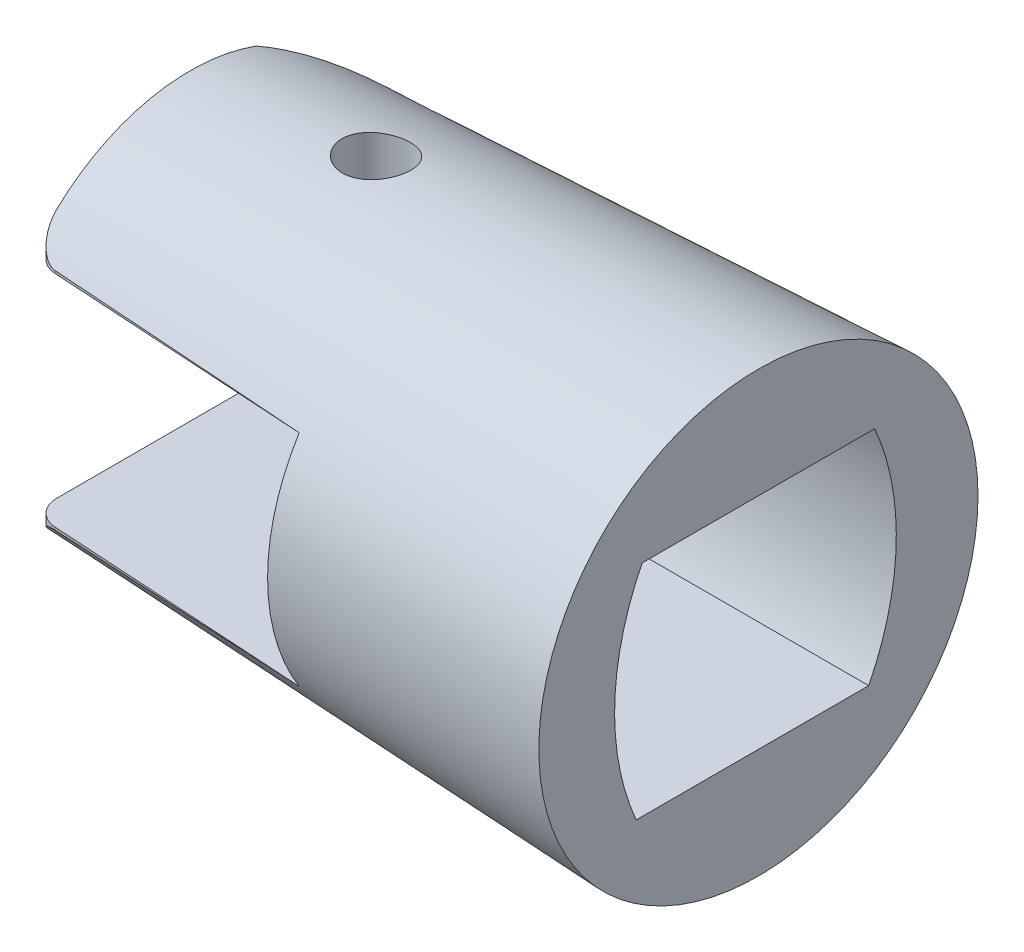
ISO-10303-21;
HEADER;
FILE_DESCRIPTION(('STEP AP214'),'2;1');
FILE_NAME('part.step','',(''),(''),'','','');
FILE_SCHEMA(('AUTOMOTIVE_DESIGN { 1 0 10303 214 1 1 1 1 }'));
ENDSEC;
DATA;
#1=APPLICATION_CONTEXT('core data for automotive mechanical design processes');
#2=APPLICATION_PROTOCOL_DEFINITION('international standard','automotive_design',2000,#1);
#3=PRODUCT_CONTEXT('',#1,'mechanical');
#4=PRODUCT('Part','Part','',(#3));
#5=PRODUCT_RELATED_PRODUCT_CATEGORY('part','',(#4));
#6=PRODUCT_DEFINITION_FORMATION('','',#4);
#7=PRODUCT_DEFINITION_CONTEXT('part definition',#1,'design');
#8=PRODUCT_DEFINITION('design','',#6,#7);
#9=PRODUCT_DEFINITION_SHAPE('','',#8);
#10=(LENGTH_UNIT() NAMED_UNIT(*) SI_UNIT(.MILLI.,.METRE.));
#11=(NAMED_UNIT(*) PLANE_ANGLE_UNIT() SI_UNIT($,.RADIAN.));
#12=(NAMED_UNIT(*) SI_UNIT($,.STERADIAN.) SOLID_ANGLE_UNIT());
#13=UNCERTAINTY_MEASURE_WITH_UNIT(LENGTH_MEASURE(1.E-05),#10,'distance_accuracy_value','');
#14=(GEOMETRIC_REPRESENTATION_CONTEXT(3) GLOBAL_UNCERTAINTY_ASSIGNED_CONTEXT((#13)) GLOBAL_UNIT_ASSIGNED_CONTEXT((#10,
#11,#12)) REPRESENTATION_CONTEXT('',''));
#15=CARTESIAN_POINT('',(0.,0.,0.));
#16=DIRECTION('',(0.,0.,1.));
#17=DIRECTION('',(1.,0.,0.));
#18=AXIS2_PLACEMENT_3D('',#15,#16,#17);
#19=CARTESIAN_POINT('',(-9.1685,3.542375,8.335));
#20=DIRECTION('',(-1.,0.,0.));
#21=DIRECTION('',(0.,-1.,0.));
#22=AXIS2_PLACEMENT_3D('',#19,#20,#21);
#23=PLANE('',#22);
#24=CARTESIAN_POINT('',(-9.1685,-0.204061880803906,-3.69481483405741));
#25=DIRECTION('',(-1.,0.,0.));
#26=DIRECTION('',(0.,-1.,0.));
#27=AXIS2_PLACEMENT_3D('',#24,#25,#26);
#28=CIRCLE('',#27,8.335);
#29=CARTESIAN_POINT('',(-9.1685,-3.542375,3.942455));
#30=VERTEX_POINT('',#29);
#31=CARTESIAN_POINT('',(-9.1685,3.542375,3.75075));
#32=VERTEX_POINT('',#31);
#33=EDGE_CURVE('E354',#30,#32,#28,.T.);
#34=ORIENTED_EDGE('',*,*,#33,.F.);
#35=DIRECTION('',(0.,0.,-1.));
#36=VECTOR('',#35,1.);
#37=CARTESIAN_POINT('',(-9.1685,-3.542375,8.335));
#38=LINE('',#37,#36);
#39=CARTESIAN_POINT('',(-9.1685,-3.542375,5.64923033336179));
#40=VERTEX_POINT('',#39);
#41=EDGE_CURVE('E247',#40,#30,#38,.T.);
#42=ORIENTED_EDGE('',*,*,#41,.F.);
#43=CARTESIAN_POINT('',(-9.1685,0.,0.));
#44=DIRECTION('',(-1.,0.,0.));
#45=DIRECTION('',(0.,-1.,0.));
#46=AXIS2_PLACEMENT_3D('',#43,#44,#45);
#47=CIRCLE('',#46,6.668);
#48=CARTESIAN_POINT('',(-9.1685,3.542375,5.64923033336179));
#49=VERTEX_POINT('',#48);
#50=EDGE_CURVE('E266',#49,#40,#47,.F.);
#51=ORIENTED_EDGE('',*,*,#50,.F.);
#52=DIRECTION('',(0.,0.,-1.));
#53=VECTOR('',#52,1.);
#54=CARTESIAN_POINT('',(-9.1685,3.542375,8.335));
#55=LINE('',#54,#53);
#56=EDGE_CURVE('E243',#49,#32,#55,.T.);
#57=ORIENTED_EDGE('',*,*,#56,.T.);
#58=EDGE_LOOP('',(#34,#42,#51,#57));
#59=FACE_BOUND('',#58,.T.);
#60=ADVANCED_FACE('F42',(#59),#23,.T.);
#61=CARTESIAN_POINT('',(-18.337,0.,0.));
#62=DIRECTION('',(1.,0.,0.));
#63=DIRECTION('',(0.,0.,-1.));
#64=AXIS2_PLACEMENT_3D('',#61,#62,#63);
#65=CONICAL_SURFACE('',#64,6.25125,0.0454232794215771);
#66=CARTESIAN_POINT('',(-13.5019586071199,6.36971735423623,-1.14055263552959));
#67=CARTESIAN_POINT('',(-13.4617716610966,6.36412320489724,-1.18215851716733));
#68=CARTESIAN_POINT('',(-13.4180697769176,6.35886841394281,-1.22045594766293));
#69=CARTESIAN_POINT('',(-13.3247991760596,6.3495885473435,-1.28933223952378));
#70=CARTESIAN_POINT('',(-13.2752260093137,6.34556441284183,-1.31990519051114));
#71=CARTESIAN_POINT('',(-13.1715607820635,6.33923527470254,-1.37242241009831));
#72=CARTESIAN_POINT('',(-13.117466539542,6.33693110656639,-1.39436248269411));
#73=CARTESIAN_POINT('',(-13.0063419314616,6.33440801953943,-1.42891486433509));
#74=CARTESIAN_POINT('',(-12.9493123346254,6.33418855746263,-1.441529602377));
#75=CARTESIAN_POINT('',(-12.8347742077037,6.33599941357175,-1.45695979163238));
#76=CARTESIAN_POINT('',(-12.7772828822114,6.33799901770215,-1.45990684419627));
#77=CARTESIAN_POINT('',(-12.66271516082,6.34416589084581,-1.45632592736047));
#78=CARTESIAN_POINT('',(-12.605638771797,6.34833319569773,-1.44979780130418));
#79=CARTESIAN_POINT('',(-12.4935917215413,6.35859421090259,-1.42754270438879));
#80=CARTESIAN_POINT('',(-12.4386178068363,6.36468479763606,-1.4118306143207));
#81=CARTESIAN_POINT('',(-12.3321352976627,6.37839738600322,-1.37173315382461));
#82=CARTESIAN_POINT('',(-12.2806271160016,6.38601956963775,-1.34734675235603));
#83=CARTESIAN_POINT('',(-12.18128278678,6.40246453529107,-1.28997421611997));
#84=CARTESIAN_POINT('',(-12.1335544490278,6.4113103447212,-1.25680804585947));
#85=CARTESIAN_POINT('',(-12.0443049808552,6.4294504705834,-1.18306878783295));
#86=CARTESIAN_POINT('',(-12.0027847443369,6.4387448513507,-1.14249463525903));
#87=CARTESIAN_POINT('',(-11.9261868389199,6.45735080289865,-1.05402953077276));
#88=CARTESIAN_POINT('',(-11.8912716887303,6.46665822080961,-1.00599678847637));
#89=CARTESIAN_POINT('',(-11.8300392561206,6.48443127201885,-0.904587548632134));
#90=CARTESIAN_POINT('',(-11.8037219229022,6.49289691029039,-0.851211082658894));
#91=CARTESIAN_POINT('',(-11.7605673710761,6.50839634642142,-0.740753092794574));
#92=CARTESIAN_POINT('',(-11.7437001489029,6.51543463011493,-0.683683944152814));
#93=CARTESIAN_POINT('',(-11.7199043216311,6.52768142906514,-0.567320625994102));
#94=CARTESIAN_POINT('',(-11.7129742159587,6.53289022049819,-0.508026793807791));
#95=CARTESIAN_POINT('',(-11.7093849880709,6.54112892195211,-0.390331837808215));
#96=CARTESIAN_POINT('',(-11.7124966428107,6.54420553883841,-0.331940938549516));
#97=CARTESIAN_POINT('',(-11.7284528636226,6.54831759628682,-0.216433119904564));
#98=CARTESIAN_POINT('',(-11.7412965600254,6.54935321920535,-0.159316087153196));
#99=CARTESIAN_POINT('',(-11.7760988297337,6.54952034401941,-0.0488478875469248));
#100=CARTESIAN_POINT('',(-11.7979219574535,6.54867935238531,0.00454600412940212));
#101=CARTESIAN_POINT('',(-11.8500413478639,6.54543836097601,0.106971117293564));
#102=CARTESIAN_POINT('',(-11.8803378998413,6.54303830796999,0.156002189757255));
#103=CARTESIAN_POINT('',(-11.9487637690071,6.53706266680899,0.248659267568056));
#104=CARTESIAN_POINT('',(-11.9869420357534,6.53347964418474,0.292248622895795));
#105=CARTESIAN_POINT('',(-12.0699463889913,6.5256183650566,0.372482766406912));
#106=CARTESIAN_POINT('',(-12.1147730135448,6.52134005227914,0.409126991963025));
#107=CARTESIAN_POINT('',(-12.2105192248659,6.51251616246562,0.474949307668603));
#108=CARTESIAN_POINT('',(-12.2615150564167,6.50796769053918,0.504016164419148));
#109=CARTESIAN_POINT('',(-12.3676767434695,6.49912926922087,0.553197692165532));
#110=CARTESIAN_POINT('',(-12.4228426803699,6.49483932487825,0.573312188362951));
#111=CARTESIAN_POINT('',(-12.5360268180653,6.48688441787331,0.604069794275444));
#112=CARTESIAN_POINT('',(-12.5940550496525,6.48322188905757,0.614676666624468));
#113=CARTESIAN_POINT('',(-12.7111177857693,6.47679656328705,0.625960067390901));
#114=CARTESIAN_POINT('',(-12.7701522518324,6.47403373201934,0.626636974563733));
#115=CARTESIAN_POINT('',(-12.8871853496133,6.46951565682789,0.618044415914074));
#116=CARTESIAN_POINT('',(-12.945188009972,6.46775464310156,0.608832807187882));
#117=CARTESIAN_POINT('',(-13.0588447326471,6.46514461624008,0.580803416808243));
#118=CARTESIAN_POINT('',(-13.1144988188864,6.46429559381307,0.561985733029535));
#119=CARTESIAN_POINT('',(-13.2217147354103,6.463291566282,0.515342450749403));
#120=CARTESIAN_POINT('',(-13.2732875432475,6.46313463268588,0.487542114845976));
#121=CARTESIAN_POINT('',(-13.3710551867452,6.46317931937109,0.423704303595212));
#122=CARTESIAN_POINT('',(-13.4172499008782,6.46338094775309,0.38766664216553));
#123=CARTESIAN_POINT('',(-13.503075999236,6.46374889883847,0.308261270240585));
#124=CARTESIAN_POINT('',(-13.5426891103938,6.46391512359644,0.26487380589709));
#125=CARTESIAN_POINT('',(-13.6140744308321,6.46380459058346,0.172067695741734));
#126=CARTESIAN_POINT('',(-13.645846696026,6.46352783597152,0.122649092941951));
#127=CARTESIAN_POINT('',(-13.7006424871472,6.46217164566769,0.0191969680552867));
#128=CARTESIAN_POINT('',(-13.723667328069,6.46109233069637,-0.0348358588813569));
#129=CARTESIAN_POINT('',(-13.7603213138993,6.4578703411098,-0.145966810634466));
#130=CARTESIAN_POINT('',(-13.7739510396044,6.4557277322404,-0.203064745733771));
#131=CARTESIAN_POINT('',(-13.7914128051149,6.45026810792188,-0.318462500793818));
#132=CARTESIAN_POINT('',(-13.7952815611174,6.44695554707829,-0.376756982727874));
#133=CARTESIAN_POINT('',(-13.7932510697703,6.43919387140256,-0.493109693253887));
#134=CARTESIAN_POINT('',(-13.787349941364,6.43474453783999,-0.551167874191738));
#135=CARTESIAN_POINT('',(-13.7659557953699,6.42489931189144,-0.665564894221748));
#136=CARTESIAN_POINT('',(-13.7504366767053,6.41950087249657,-0.721898615498752));
#137=CARTESIAN_POINT('',(-13.7102529447442,6.4081192459103,-0.831103504416171));
#138=CARTESIAN_POINT('',(-13.6855955394343,6.40213652231534,-0.883977362515132));
#139=CARTESIAN_POINT('',(-13.6353283839342,6.39161911118874,-0.971785450895304));
#140=CARTESIAN_POINT('',(-13.6116140479203,6.38711007390803,-1.00782284775294));
#141=CARTESIAN_POINT('',(-13.5599033905768,6.37824365249002,-1.07670352414049));
#142=CARTESIAN_POINT('',(-13.5319070346157,6.37388626957959,-1.1095467778338));
#143=CARTESIAN_POINT('',(-13.5019586071199,6.36971735423623,-1.14055263552959));
#144=B_SPLINE_CURVE_WITH_KNOTS('',3,(#66,#67,#68,#69,#70,#71,#72,#73,#74,#75,#76,#77,#78,#79,
#80,#81,#82,#83,#84,#85,#86,#87,#88,#89,#90,#91,#92,#93,#94,#95,#96,#97,#98,#99,#100,#101,#102,
#103,#104,#105,#106,#107,#108,#109,#110,#111,#112,#113,#114,#115,#116,#117,#118,#119,#120,#121,
#122,#123,#124,#125,#126,#127,#128,#129,#130,#131,#132,#133,#134,#135,#136,#137,#138,#139,#140,
#141,#142,#143),.UNSPECIFIED.,.T.,.F.,(4,2,2,2,2,2,2,2,2,2,2,2,2,2,2,2,2,2,2,2,2,2,2,2,2,2,2,2,
2,2,2,2,2,2,2,2,2,2,4),(0.,0.174191630600131,0.348516142851444,0.522925281043474,
0.697288974362851,0.869269071700751,1.04125201248106,1.21295705848974,1.38468252041971,
1.56024634392888,1.73583542251076,1.91530202996102,2.09476757705439,2.27366005459238,
2.45252551527688,2.62733714810069,2.80213316134307,2.97438395680036,3.14664063370265,
3.32000116030165,3.49337572489717,3.66916783834825,3.84496338406006,4.02142614263796,
4.19788217043694,4.37331136381457,4.54873876980827,4.72367704063105,4.89861926372467,
5.07403935865661,5.24945820262374,5.42485066554725,5.60023228491239,5.77495321053123,
5.94970778016928,6.12493868394181,6.30003166436285,6.42984305195004,6.55965548946091),.UNSPECIFIED.);
#145=CARTESIAN_POINT('',(-13.5019586071199,6.36971735423623,-1.14055263552959));
#146=VERTEX_POINT('',#145);
#147=EDGE_CURVE('E178',#146,#146,#144,.T.);
#148=ORIENTED_EDGE('',*,*,#147,.T.);
#149=EDGE_LOOP('',(#148));
#150=FACE_BOUND('',#149,.T.);
#151=CARTESIAN_POINT('',(0.,0.,0.));
#152=DIRECTION('',(1.,0.,0.));
#153=DIRECTION('',(0.,0.,-1.));
#154=AXIS2_PLACEMENT_3D('',#151,#152,#153);
#155=CIRCLE('',#154,7.08475);
#156=CARTESIAN_POINT('',(0.,0.,-7.08475));
#157=VERTEX_POINT('',#156);
#158=EDGE_CURVE('E263',#157,#157,#155,.T.);
#159=ORIENTED_EDGE('',*,*,#158,.F.);
#160=EDGE_LOOP('',(#159));
#161=FACE_BOUND('',#160,.T.);
#162=CARTESIAN_POINT('',(-34.5041081604003,0.,4.09963815516563));
#163=DIRECTION('',(-0.0610485395348602,0.,0.998134798421867));
#164=DIRECTION('',(0.998134798421867,0.,0.0610485395348602));
#165=AXIS2_PLACEMENT_3D('',#162,#163,#164);
#166=ELLIPSE('',#165,90.3605801102719,3.69099326311018);
#167=CARTESIAN_POINT('',(-17.5543839577023,-3.62522922712277,5.13632769823078));
#168=VERTEX_POINT('',#167);
#169=EDGE_CURVE('E432',#40,#168,#166,.F.);
#170=ORIENTED_EDGE('',*,*,#169,.T.);
#171=CARTESIAN_POINT('',(-17.5543839577023,-3.62522922712277,5.13632769823078));
#172=CARTESIAN_POINT('',(-17.5835191435355,-3.62539717459501,5.13458204197888));
#173=CARTESIAN_POINT('',(-17.6124407533959,-3.62785684995634,5.13124299283005));
#174=CARTESIAN_POINT('',(-17.6688884168199,-3.63675828304935,5.12179446868215));
#175=CARTESIAN_POINT('',(-17.696426051236,-3.64315736018139,5.11571487211696));
#176=CARTESIAN_POINT('',(-17.756397235893,-3.66137164352762,5.09934388125484));
#177=CARTESIAN_POINT('',(-17.7883530178643,-3.67413604047358,5.08838211572725));
#178=CARTESIAN_POINT('',(-17.849230934616,-3.70364974125853,5.06351345277671));
#179=CARTESIAN_POINT('',(-17.878138434752,-3.72041710985499,5.04959323655003));
#180=CARTESIAN_POINT('',(-17.9467530692136,-3.76604460672441,5.01182369410971));
#181=CARTESIAN_POINT('',(-17.9844507795672,-3.79671127967948,4.98653080374656));
#182=CARTESIAN_POINT('',(-18.0533650839513,-3.86181066792531,4.93231314277607));
#183=CARTESIAN_POINT('',(-18.0845679294244,-3.89625114130658,4.90338087164892));
#184=CARTESIAN_POINT('',(-18.1560385241076,-3.98598020526759,4.82680375002701));
#185=CARTESIAN_POINT('',(-18.1924803505367,-4.04273127487288,4.7773017326093));
#186=CARTESIAN_POINT('',(-18.2532359610207,-4.15817705163775,4.67347504779416));
#187=CARTESIAN_POINT('',(-18.2775417639236,-4.21687301085593,4.61914723433888));
#188=CARTESIAN_POINT('',(-18.3094053683784,-4.3189646501273,4.52149820301437));
#189=CARTESIAN_POINT('',(-18.319683239889,-4.3623377902344,4.47902489375344));
#190=CARTESIAN_POINT('',(-18.3334494794043,-4.4484012157479,4.39267745596563));
#191=CARTESIAN_POINT('',(-18.336965415419,-4.49109356705382,4.34880975969335));
#192=CARTESIAN_POINT('',(-18.3369999999996,-4.5332577855509,4.30438153655579));
#193=B_SPLINE_CURVE_WITH_KNOTS('',3,(#171,#172,#173,#174,#175,#176,#177,#178,#179,#180,#181,
#182,#183,#184,#185,#186,#187,#188,#189,#190,#191,#192),.UNSPECIFIED.,.F.,.F.,(4,2,2,2,2,2,2,2,
2,2,4),(0.,0.0872788149635095,0.173628274098218,0.281375446667443,0.389618375482221,
0.553055908841983,0.716835970926985,0.966494825302895,1.21631765014758,1.40065316914786,
1.58423555666849),.UNSPECIFIED.);
#194=CARTESIAN_POINT('',(-18.337,-4.5332582105943,4.30438194016369));
#195=VERTEX_POINT('',#194);
#196=EDGE_CURVE('E363',#168,#195,#193,.T.);
#197=ORIENTED_EDGE('',*,*,#196,.T.);
#198=CARTESIAN_POINT('',(-18.337,0.,0.));
#199=DIRECTION('',(1.,0.,0.));
#200=DIRECTION('',(0.,0.,-1.));
#201=AXIS2_PLACEMENT_3D('',#198,#199,#200);
#202=CIRCLE('',#201,6.25125);
#203=CARTESIAN_POINT('',(-18.3369999999999,-5.87658981540671,-2.13162349019666));
#204=VERTEX_POINT('',#203);
#205=EDGE_CURVE('E272',#195,#204,#202,.T.);
#206=ORIENTED_EDGE('',*,*,#205,.T.);
#207=CARTESIAN_POINT('',(-18.3372567700002,-5.87674747860965,-2.13115454954993));
#208=CARTESIAN_POINT('',(-18.2423294126869,-5.8184692490237,-2.30454073447208));
#209=CARTESIAN_POINT('',(-18.1409625006472,-5.75405537026979,-2.47212877626095));
#210=CARTESIAN_POINT('',(-17.9268873244713,-5.6151575115782,-2.79505347200545));
#211=CARTESIAN_POINT('',(-17.8141981106003,-5.54069037645025,-2.95040994566567));
#212=CARTESIAN_POINT('',(-17.5789801900571,-5.38387204782082,-3.24842881058492));
#213=CARTESIAN_POINT('',(-17.4564761685077,-5.30154053941646,-3.39112125720009));
#214=CARTESIAN_POINT('',(-17.2023512007276,-5.13074553231019,-3.66428311060505));
#215=CARTESIAN_POINT('',(-17.0707263371003,-5.04227939877835,-3.79474720801791));
#216=CARTESIAN_POINT('',(-16.8000637235818,-4.86176961970861,-4.0426413121732));
#217=CARTESIAN_POINT('',(-16.6610821689153,-4.7697542367641,-4.16015355226417));
#218=CARTESIAN_POINT('',(-16.3753141418655,-4.58351798121941,-4.38330075663128));
#219=CARTESIAN_POINT('',(-16.2285281160942,-4.4892972349938,-4.48893639947214));
#220=CARTESIAN_POINT('',(-15.9274229690926,-4.30090749229415,-4.68832656957107));
#221=CARTESIAN_POINT('',(-15.7731138595806,-4.20673858706263,-4.78209632067535));
#222=CARTESIAN_POINT('',(-15.4565072655595,-4.02088731267653,-4.95792175704519));
#223=CARTESIAN_POINT('',(-15.2942106879906,-3.9292046630442,-5.03997876813072));
#224=CARTESIAN_POINT('',(-15.0225818337167,-3.78453120301848,-5.16402371782553));
#225=CARTESIAN_POINT('',(-14.915834178667,-3.72975971111061,-5.20961497760378));
#226=CARTESIAN_POINT('',(-14.698752330446,-3.62371003482244,-5.29588928003951));
#227=CARTESIAN_POINT('',(-14.5884203081758,-3.57242979212744,-5.33657522579488));
#228=CARTESIAN_POINT('',(-14.3637589629852,-3.47461973201655,-5.41290595950828));
#229=CARTESIAN_POINT('',(-14.2494250792039,-3.42809558847101,-5.44854474544861));
#230=CARTESIAN_POINT('',(-14.0166046533367,-3.34154145003611,-5.5144386646745));
#231=CARTESIAN_POINT('',(-13.8981115599538,-3.30152231596982,-5.54468480233568));
#232=CARTESIAN_POINT('',(-13.7775883,-3.26567429014589,-5.57203211015114));
#233=B_SPLINE_CURVE_WITH_KNOTS('',3,(#207,#208,#209,#210,#211,#212,#213,#214,#215,#216,#217,
#218,#219,#220,#221,#222,#223,#224,#225,#226,#227,#228,#229,#230,#231,#232),.UNSPECIFIED.,.F.,
.F.,(4,2,2,2,2,2,2,2,2,2,2,2,4),(0.,0.617722605789247,1.23442273883692,1.84961777607366,
2.46507869684957,3.0763744709625,3.68763530116436,4.29810376103265,4.90850306422099,
5.29339137725125,5.67805077299071,6.06316382723693,6.44891340803633),.UNSPECIFIED.);
#234=CARTESIAN_POINT('',(-14.5190269000325,-3.542375,-5.35999629482709));
#235=VERTEX_POINT('',#234);
#236=EDGE_CURVE('E236',#204,#235,#233,.T.);
#237=ORIENTED_EDGE('',*,*,#236,.T.);
#238=CARTESIAN_POINT('',(-35.2145239719042,-3.542375,-4.18650456912061));
#239=CARTESIAN_POINT('',(-33.4689798185686,-3.542375,-4.29041241927889));
#240=CARTESIAN_POINT('',(-31.7233440938123,-3.542375,-4.39276675358282));
#241=CARTESIAN_POINT('',(-28.2319248412182,-3.542375,-4.5948589560641));
#242=CARTESIAN_POINT('',(-26.4861413137063,-3.542375,-4.69459682986907));
#243=CARTESIAN_POINT('',(-22.0366149811897,-3.542375,-4.9460842353579));
#244=CARTESIAN_POINT('',(-19.3327882979209,-3.542375,-5.09634776882417));
#245=CARTESIAN_POINT('',(-13.9249199355783,-3.542375,-5.39297364008887));
#246=CARTESIAN_POINT('',(-11.2208782563778,-3.542375,-5.53933597557062));
#247=CARTESIAN_POINT('',(-5.81261229454535,-3.542375,-5.82899950095595));
#248=CARTESIAN_POINT('',(-3.10838801077013,-3.542375,-5.97230066947658));
#249=CARTESIAN_POINT('',(2.30018797093892,-3.542375,-6.25640839517562));
#250=CARTESIAN_POINT('',(5.00453966869321,-3.542375,-6.39721495576955));
#251=CARTESIAN_POINT('',(7.70894062190417,-3.542375,-6.53705820162685));
#252=B_SPLINE_CURVE_WITH_KNOTS('',3,(#238,#239,#240,#241,#242,#243,#244,#245,#246,#247,#248,
#249,#250,#251),.UNSPECIFIED.,.F.,.F.,(4,2,2,2,2,2,4),(0.,5.24590028454248,10.4917892849977,
18.6157819821045,26.7397795034309,34.8638337541247,42.9878768807833),.UNSPECIFIED.);
#253=CARTESIAN_POINT('',(-9.1685,-3.542375,-5.64923033336179));
#254=VERTEX_POINT('',#253);
#255=EDGE_CURVE('E285',#235,#254,#252,.T.);
#256=ORIENTED_EDGE('',*,*,#255,.T.);
#257=CARTESIAN_POINT('',(-9.1685,3.542375,-5.6492303333618));
#258=VERTEX_POINT('',#257);
#259=EDGE_CURVE('E397',#254,#258,#47,.F.);
#260=ORIENTED_EDGE('',*,*,#259,.T.);
#261=CARTESIAN_POINT('',(7.70894062190416,3.542375,-6.53705820162685));
#262=CARTESIAN_POINT('',(5.34136437674105,3.542375,-6.41464077103996));
#263=CARTESIAN_POINT('',(2.97382657835841,3.542375,-6.29147422101618));
#264=CARTESIAN_POINT('',(-1.76114674899523,3.542375,-6.04328086722644));
#265=CARTESIAN_POINT('',(-4.12858227815992,3.542375,-5.91825406715389));
#266=CARTESIAN_POINT('',(-8.88951329233916,3.542375,-5.66458289247028));
#267=CARTESIAN_POINT('',(-11.2830074625838,3.542375,-5.53591380300669));
#268=CARTESIAN_POINT('',(-16.0698432043344,3.542375,-5.27577752322633));
#269=CARTESIAN_POINT('',(-18.463184775885,3.542375,-5.14431033373396));
#270=CARTESIAN_POINT('',(-23.2496830764965,3.542375,-4.87787263022865));
#271=CARTESIAN_POINT('',(-25.6428398047839,3.542375,-4.7429021022772));
#272=CARTESIAN_POINT('',(-29.2323822022292,3.542375,-4.53706088482476));
#273=CARTESIAN_POINT('',(-30.4288649438516,3.542375,-4.46788286514102));
#274=CARTESIAN_POINT('',(-32.8217544457568,3.542375,-4.32821921009523));
#275=CARTESIAN_POINT('',(-34.0181612060159,3.542375,-4.25773357432816));
#276=CARTESIAN_POINT('',(-35.2145239719041,3.542375,-4.18650456912061));
#277=B_SPLINE_CURVE_WITH_KNOTS('',3,(#261,#262,#263,#264,#265,#266,#267,#268,#269,#270,#271,
#272,#273,#274,#275,#276),.UNSPECIFIED.,.F.,.F.,(4,2,2,2,2,2,2,4),(0.,7.11221723988196,
14.2244203607457,21.4152694802321,28.6061164811368,35.79699209619,39.3924342611634,
42.9878775398138),.UNSPECIFIED.);
#278=CARTESIAN_POINT('',(-14.5190269000325,3.542375,-5.35999629482711));
#279=VERTEX_POINT('',#278);
#280=EDGE_CURVE('E396',#258,#279,#277,.T.);
#281=ORIENTED_EDGE('',*,*,#280,.T.);
#282=CARTESIAN_POINT('',(-13.7775883,3.26567429014588,-5.57203211015114));
#283=CARTESIAN_POINT('',(-13.8738367297011,3.29428071637391,-5.5501979147964));
#284=CARTESIAN_POINT('',(-13.9687946475318,3.32557528289693,-5.52650777144988));
#285=CARTESIAN_POINT('',(-14.1560890790273,3.39257124539947,-5.47562240293109));
#286=CARTESIAN_POINT('',(-14.2484278793053,3.42826864211445,-5.44843035769731));
#287=CARTESIAN_POINT('',(-14.521133462861,3.54036167681916,-5.36202996778344));
#288=CARTESIAN_POINT('',(-14.6977992434197,3.62195158377528,-5.29785647304371));
#289=CARTESIAN_POINT('',(-15.0422135950064,3.79337118771676,-5.15709166533307));
#290=CARTESIAN_POINT('',(-15.209945920897,3.88321513700832,-5.08047869117341));
#291=CARTESIAN_POINT('',(-15.5371790362246,4.06709805382019,-4.91522223154567));
#292=CARTESIAN_POINT('',(-15.6966724207883,4.16114065816431,-4.82656817499276));
#293=CARTESIAN_POINT('',(-16.0059144746845,4.34925773014024,-4.63848092749057));
#294=CARTESIAN_POINT('',(-16.1557550068599,4.44331906885807,-4.53918531118976));
#295=CARTESIAN_POINT('',(-16.447748905019,4.63024645715547,-4.32893946776924));
#296=CARTESIAN_POINT('',(-16.5899041904439,4.72311280073654,-4.21799217129385));
#297=CARTESIAN_POINT('',(-16.8659935242385,4.90547982448777,-3.9845545866165));
#298=CARTESIAN_POINT('',(-16.9999466516398,4.99498811195495,-3.86209290811507));
#299=CARTESIAN_POINT('',(-17.2594098237596,5.16900965829553,-3.60531386708897));
#300=CARTESIAN_POINT('',(-17.3849214924307,5.25352387753677,-3.47099879646044));
#301=CARTESIAN_POINT('',(-17.6611095575783,5.4388244890841,-3.15048871245494));
#302=CARTESIAN_POINT('',(-17.8088075074836,5.5374142512299,-2.96039414914252));
#303=CARTESIAN_POINT('',(-18.0868665782116,5.71954479093961,-2.56040924384974));
#304=CARTESIAN_POINT('',(-18.2171765379253,5.80304140455416,-2.35046346060313));
#305=CARTESIAN_POINT('',(-18.3372567700002,5.87674747860965,-2.13115454954994));
#306=B_SPLINE_CURVE_WITH_KNOTS('',3,(#282,#283,#284,#285,#286,#287,#288,#289,#290,#291,#292,
#293,#294,#295,#296,#297,#298,#299,#300,#301,#302,#303,#304,#305),.UNSPECIFIED.,.F.,.F.,(4,2,2,
2,2,2,2,2,2,2,2,4),(0.,0.308106731902511,0.615935631404688,1.22963932038888,1.84442336004434,
2.45975066115127,3.06791105757453,3.67591885347412,4.28245396649421,4.88887205963713,
5.66753865798373,6.44844807195989),.UNSPECIFIED.);
#307=CARTESIAN_POINT('',(-18.3369999999998,5.87658981540668,-2.13162349019676));
#308=VERTEX_POINT('',#307);
#309=EDGE_CURVE('E437',#279,#308,#306,.T.);
#310=ORIENTED_EDGE('',*,*,#309,.T.);
#311=CARTESIAN_POINT('',(-18.337,0.,0.));
#312=DIRECTION('',(1.,0.,0.));
#313=DIRECTION('',(0.,0.,-1.));
#314=AXIS2_PLACEMENT_3D('',#311,#312,#313);
#315=CIRCLE('',#314,6.25125);
#316=CARTESIAN_POINT('',(-18.337,4.53325798412859,4.30438201684952));
#317=VERTEX_POINT('',#316);
#318=EDGE_CURVE('E267',#308,#317,#315,.T.);
#319=ORIENTED_EDGE('',*,*,#318,.T.);
#320=CARTESIAN_POINT('',(-18.3369999999997,4.53325763985247,4.3043816900014));
#321=CARTESIAN_POINT('',(-18.3369900007714,4.5019204853815,4.3373923512186));
#322=CARTESIAN_POINT('',(-18.3350391930366,4.4702888654298,4.37010635637799));
#323=CARTESIAN_POINT('',(-18.3273878209806,4.40666071083242,4.43474608374188));
#324=CARTESIAN_POINT('',(-18.3216865191009,4.37466410562654,4.46667164961324));
#325=CARTESIAN_POINT('',(-18.3065997019521,4.31025893903589,4.52980434711778));
#326=CARTESIAN_POINT('',(-18.2971820469495,4.27784923707471,4.56100262692784));
#327=CARTESIAN_POINT('',(-18.274718911652,4.2131719828961,4.6221956869404));
#328=CARTESIAN_POINT('',(-18.2616741576944,4.18090440353104,4.65219070672461));
#329=CARTESIAN_POINT('',(-18.2230281934887,4.09758494102618,4.72837515714503));
#330=CARTESIAN_POINT('',(-18.194585091219,4.04685212879629,4.77350952270905));
#331=CARTESIAN_POINT('',(-18.1278359269416,3.94829582715103,4.85924566474822));
#332=CARTESIAN_POINT('',(-18.089565345878,3.90046262140484,4.89986300871113));
#333=CARTESIAN_POINT('',(-18.019901479834,3.82922354786198,4.95951433641711));
#334=CARTESIAN_POINT('',(-17.9921900301683,3.80388462810824,4.98053690417488));
#335=CARTESIAN_POINT('',(-17.9324747598755,3.7563011442107,5.01991033981238));
#336=CARTESIAN_POINT('',(-17.9004747881006,3.73405384146174,5.03826357291309));
#337=CARTESIAN_POINT('',(-17.8397141142586,3.69875170673442,5.06763087124838));
#338=CARTESIAN_POINT('',(-17.811856580005,3.6847557421689,5.07936610939417));
#339=CARTESIAN_POINT('',(-17.7536207842187,3.66059450726753,5.10006470006304));
#340=CARTESIAN_POINT('',(-17.7232516440859,3.65041605924359,5.10903756842507));
#341=CARTESIAN_POINT('',(-17.6697776545947,3.63718401084075,5.12144280344581));
#342=CARTESIAN_POINT('',(-17.6471710193752,3.63291453825756,5.12572871478402));
#343=CARTESIAN_POINT('',(-17.6012115911903,3.62700726506418,5.13246725113648));
#344=CARTESIAN_POINT('',(-17.5778551040057,3.62538558452628,5.13490859825752));
#345=CARTESIAN_POINT('',(-17.5543839577023,3.62522922712268,5.13632769823078));
#346=B_SPLINE_CURVE_WITH_KNOTS('',3,(#320,#321,#322,#323,#324,#325,#326,#327,#328,#329,#330,
#331,#332,#333,#334,#335,#336,#337,#338,#339,#340,#341,#342,#343,#344,#345),.UNSPECIFIED.,.F.,
.F.,(4,2,2,2,2,2,2,2,2,2,2,2,4),(0.,0.136487294692899,0.273001438504433,0.410723008082527,
0.548417018346911,0.768542799688636,0.987884751057089,1.11668829776922,1.24537701080496,
1.34497276483024,1.44422148893829,1.51420763269629,1.5846182928181),.UNSPECIFIED.);
#347=CARTESIAN_POINT('',(-17.5543839577023,3.62522922712277,5.13632769823078));
#348=VERTEX_POINT('',#347);
#349=EDGE_CURVE('E313',#317,#348,#346,.T.);
#350=ORIENTED_EDGE('',*,*,#349,.T.);
#351=EDGE_CURVE('E307',#348,#49,#166,.F.);
#352=ORIENTED_EDGE('',*,*,#351,.T.);
#353=ORIENTED_EDGE('',*,*,#50,.T.);
#354=EDGE_LOOP('',(#170,#197,#206,#237,#256,#260,#281,#310,#319,#350,#352,#353));
#355=FACE_BOUND('',#354,.T.);
#356=CARTESIAN_POINT('',(-13.5019586071199,-6.36971735423623,-1.14055263552959));
#357=CARTESIAN_POINT('',(-13.5428066719975,-6.37540413546996,-1.09825628586421));
#358=CARTESIAN_POINT('',(-13.58006763611,-6.38144762587365,-1.05249409508984));
#359=CARTESIAN_POINT('',(-13.6463663917079,-6.39366897575192,-0.955324106215859));
#360=CARTESIAN_POINT('',(-13.675395443402,-6.39984697059432,-0.903910387647762));
#361=CARTESIAN_POINT('',(-13.7243799393292,-6.41180688956143,-0.796895358709539));
#362=CARTESIAN_POINT('',(-13.7443377916653,-6.4175889184554,-0.741295164284129));
#363=CARTESIAN_POINT('',(-13.774592276391,-6.4283343882504,-0.627464137100734));
#364=CARTESIAN_POINT('',(-13.7848915364711,-6.43329805149072,-0.569234024352602));
#365=CARTESIAN_POINT('',(-13.795482613092,-6.44211012834874,-0.452019333780096));
#366=CARTESIAN_POINT('',(-13.7958138836755,-6.44596287900734,-0.393038655073467));
#367=CARTESIAN_POINT('',(-13.7865198788824,-6.45246534078592,-0.275798179031294));
#368=CARTESIAN_POINT('',(-13.7768946954792,-6.45511506301864,-0.21753837504165));
#369=CARTESIAN_POINT('',(-13.7480693396878,-6.45924947972682,-0.103942480535163));
#370=CARTESIAN_POINT('',(-13.7289540063645,-6.4607442021743,-0.0485852053769086));
#371=CARTESIAN_POINT('',(-13.68172462358,-6.46281230927654,0.0581653602845548));
#372=CARTESIAN_POINT('',(-13.6536105611033,-6.46338569259868,0.109558645054155));
#373=CARTESIAN_POINT('',(-13.5891901188293,-6.46393227871482,0.20690240199245));
#374=CARTESIAN_POINT('',(-13.5528864295416,-6.46390567833591,0.252854654141272));
#375=CARTESIAN_POINT('',(-13.4731054118816,-6.46364280390669,0.338040680446869));
#376=CARTESIAN_POINT('',(-13.4296279433928,-6.46340652576059,0.377274323346922));
#377=CARTESIAN_POINT('',(-13.3365559292968,-6.46312850546019,0.44804500715366));
#378=CARTESIAN_POINT('',(-13.2869400397184,-6.46308746284258,0.479553988560882));
#379=CARTESIAN_POINT('',(-13.1831256077271,-6.46356915635617,0.533796130358705));
#380=CARTESIAN_POINT('',(-13.1289271373615,-6.46409188362529,0.556529428689406));
#381=CARTESIAN_POINT('',(-13.0175571697455,-6.46597288758107,0.592554803398236));
#382=CARTESIAN_POINT('',(-12.9603889939032,-6.46733024845497,0.605857193568015));
#383=CARTESIAN_POINT('',(-12.844663314385,-6.47101591087335,0.622690981246411));
#384=CARTESIAN_POINT('',(-12.7861058338046,-6.47334419628806,0.626222541068429));
#385=CARTESIAN_POINT('',(-12.6693964462181,-6.47894246968521,0.623437112675399));
#386=CARTESIAN_POINT('',(-12.6112439446177,-6.48221046308233,0.617140860517183));
#387=CARTESIAN_POINT('',(-12.4968522242489,-6.48950690164895,0.594940235551905));
#388=CARTESIAN_POINT('',(-12.4406130754527,-6.49353537459441,0.579035511755841));
#389=CARTESIAN_POINT('',(-12.3313713203522,-6.50204700502672,0.537991503387273));
#390=CARTESIAN_POINT('',(-12.2783836829152,-6.50653204451106,0.512812775248384));
#391=CARTESIAN_POINT('',(-12.1773727377081,-6.51550660546867,0.453935017402473));
#392=CARTESIAN_POINT('',(-12.1293496539915,-6.519996127135,0.420235603387741));
#393=CARTESIAN_POINT('',(-12.0393855658984,-6.52850201150356,0.345058727880963));
#394=CARTESIAN_POINT('',(-11.9974749272108,-6.53251599445531,0.303544633858113));
#395=CARTESIAN_POINT('',(-11.921213481326,-6.53952980542418,0.21399656648057));
#396=CARTESIAN_POINT('',(-11.8868623454935,-6.5425296775309,0.165962876700007));
#397=CARTESIAN_POINT('',(-11.8269348277394,-6.54703158168007,0.0650785303528109));
#398=CARTESIAN_POINT('',(-11.8013004456612,-6.54854364632992,0.0122627977169063));
#399=CARTESIAN_POINT('',(-11.7592498270952,-6.54974856565019,-0.0969367692239371));
#400=CARTESIAN_POINT('',(-11.7428325982603,-6.54944161620243,-0.153320218689881));
#401=CARTESIAN_POINT('',(-11.7198553042288,-6.54682348990759,-0.267181523229828));
#402=CARTESIAN_POINT('',(-11.7131589331714,-6.54454075878839,-0.324632570543374));
#403=CARTESIAN_POINT('',(-11.7093381467646,-6.53798954912127,-0.439736106240897));
#404=CARTESIAN_POINT('',(-11.7122135149673,-6.53372111547836,-0.497388590040295));
#405=CARTESIAN_POINT('',(-11.7273695134134,-6.5233695265392,-0.611163607541463));
#406=CARTESIAN_POINT('',(-11.7396330960223,-6.51728967272837,-0.667288723638852));
#407=CARTESIAN_POINT('',(-11.7731230352385,-6.50363647241209,-0.776604568757455));
#408=CARTESIAN_POINT('',(-11.7943502905901,-6.4960629761869,-0.829795002927414));
#409=CARTESIAN_POINT('',(-11.8455999878006,-6.47972704690479,-0.932807619630457));
#410=CARTESIAN_POINT('',(-11.8757774011026,-6.47094526439383,-0.982549600954849));
#411=CARTESIAN_POINT('',(-11.9439192710086,-6.45287796684749,-1.07627879794079));
#412=CARTESIAN_POINT('',(-11.9818848539836,-6.44359237909188,-1.12026517968489));
#413=CARTESIAN_POINT('',(-12.0654659929492,-6.42495285512492,-1.20218844351162));
#414=CARTESIAN_POINT('',(-12.1112240780989,-6.41560150595709,-1.2399806796312));
#415=CARTESIAN_POINT('',(-12.2085943979047,-6.39770193589193,-1.30732262628574));
#416=CARTESIAN_POINT('',(-12.2602066786277,-6.38915372131545,-1.33687227195325));
#417=CARTESIAN_POINT('',(-12.3677702071476,-6.37350436483881,-1.38677828407294));
#418=CARTESIAN_POINT('',(-12.4237117123966,-6.36640009711033,-1.40715462753423));
#419=CARTESIAN_POINT('',(-12.5384426340422,-6.35413125620062,-1.43811675124382));
#420=CARTESIAN_POINT('',(-12.5972314632167,-6.34896628497264,-1.44870454127684));
#421=CARTESIAN_POINT('',(-12.7144234237395,-6.34101626408846,-1.45954730904702));
#422=CARTESIAN_POINT('',(-12.7727994980116,-6.33817498065284,-1.46005382267844));
#423=CARTESIAN_POINT('',(-12.8888921082784,-6.33477066263918,-1.45130399998122));
#424=CARTESIAN_POINT('',(-12.9466085934223,-6.33420780254951,-1.44204691599593));
#425=CARTESIAN_POINT('',(-13.0586557214499,-6.33524479705474,-1.4142854322848));
#426=CARTESIAN_POINT('',(-13.1130282198882,-6.3368065349373,-1.39594766829388));
#427=CARTESIAN_POINT('',(-13.2179276952477,-6.34173831671997,-1.35065872624296));
#428=CARTESIAN_POINT('',(-13.2684579968444,-6.34510677644522,-1.32371510235613));
#429=CARTESIAN_POINT('',(-13.3501540149434,-6.35202158357102,-1.27114392131203));
#430=CARTESIAN_POINT('',(-13.3826314440032,-6.35522160165655,-1.24747768994045));
#431=CARTESIAN_POINT('',(-13.4446142054502,-6.36213162936857,-1.1965951721605));
#432=CARTESIAN_POINT('',(-13.4741194771092,-6.36584164941194,-1.1693788132407));
#433=CARTESIAN_POINT('',(-13.5019586071199,-6.36971735423623,-1.14055263552959));
#434=B_SPLINE_CURVE_WITH_KNOTS('',3,(#356,#357,#358,#359,#360,#361,#362,#363,#364,#365,#366,
#367,#368,#369,#370,#371,#372,#373,#374,#375,#376,#377,#378,#379,#380,#381,#382,#383,#384,#385,
#386,#387,#388,#389,#390,#391,#392,#393,#394,#395,#396,#397,#398,#399,#400,#401,#402,#403,#404,
#405,#406,#407,#408,#409,#410,#411,#412,#413,#414,#415,#416,#417,#418,#419,#420,#421,#422,#423,
#424,#425,#426,#427,#428,#429,#430,#431,#432,#433),.UNSPECIFIED.,.T.,.F.,(4,2,2,2,2,2,2,2,2,2,2,
2,2,2,2,2,2,2,2,2,2,2,2,2,2,2,2,2,2,2,2,2,2,2,2,2,2,2,4),(0.,0.177079519336539,
0.354346345418276,0.531566085501365,0.70873759765868,0.885207759178163,1.06167629055631,
1.23659490897276,1.41151378039089,1.58637526979504,1.76124017495492,1.93673115851378,
2.11221938351477,2.28751539450684,2.4628084934575,2.63773223479839,2.81266236633577,
2.98834525568955,3.16403607026643,3.34057195284007,3.51710015932787,3.69242966905349,
3.86774029864065,4.04056815322662,4.21339209964448,4.38590296508283,4.55843113146396,
4.73414085039141,4.90987599942968,5.08926166821072,5.26864874867934,5.44764325939298,
5.62660101080624,5.80108786770941,5.97558808707765,6.14699859382478,6.31825904904723,
6.43894136464972,6.55962614557709),.UNSPECIFIED.);
#435=CARTESIAN_POINT('',(-13.5019586071199,-6.36971735423623,-1.14055263552959));
#436=VERTEX_POINT('',#435);
#437=EDGE_CURVE('E186',#436,#436,#434,.T.);
#438=ORIENTED_EDGE('',*,*,#437,.T.);
#439=EDGE_LOOP('',(#438));
#440=FACE_BOUND('',#439,.T.);
#441=ADVANCED_FACE('F191',(#150,#161,#355,#440),#65,.T.);
#442=CARTESIAN_POINT('',(-18.337,0.,0.));
#443=DIRECTION('',(1.,0.,0.));
#444=DIRECTION('',(0.,0.,-1.));
#445=AXIS2_PLACEMENT_3D('',#442,#443,#444);
#446=PLANE('',#445);
#447=ORIENTED_EDGE('',*,*,#205,.F.);
#448=DIRECTION('',(0.,-1.,0.));
#449=VECTOR('',#448,1.);
#450=CARTESIAN_POINT('',(-18.337,-3.542375,4.30438234374616));
#451=LINE('',#450,#449);
#452=CARTESIAN_POINT('',(-18.337,-3.542375,4.30438234374616));
#453=VERTEX_POINT('',#452);
#454=EDGE_CURVE('E365',#195,#453,#451,.F.);
#455=ORIENTED_EDGE('',*,*,#454,.T.);
#456=DIRECTION('',(0.,0.,1.));
#457=VECTOR('',#456,1.);
#458=CARTESIAN_POINT('',(-18.337,-3.542375,0.));
#459=LINE('',#458,#457);
#460=CARTESIAN_POINT('',(-18.337,-3.542375,-2.13162349019646));
#461=VERTEX_POINT('',#460);
#462=EDGE_CURVE('E257',#461,#453,#459,.T.);
#463=ORIENTED_EDGE('',*,*,#462,.F.);
#464=DIRECTION('',(0.,-1.,0.));
#465=VECTOR('',#464,1.);
#466=CARTESIAN_POINT('',(-18.337,8.335,-2.13162349019646));
#467=LINE('',#466,#465);
#468=EDGE_CURVE('E238',#204,#461,#467,.F.);
#469=ORIENTED_EDGE('',*,*,#468,.F.);
#470=EDGE_LOOP('',(#447,#455,#463,#469));
#471=FACE_BOUND('',#470,.T.);
#472=ADVANCED_FACE('F322',(#471),#446,.F.);
#473=DIRECTION('',(0.,0.,-1.));
#474=VECTOR('',#473,1.);
#475=CARTESIAN_POINT('',(-18.337,3.542375,0.));
#476=LINE('',#475,#474);
#477=CARTESIAN_POINT('',(-18.337,3.542375,4.30438234374616));
#478=VERTEX_POINT('',#477);
#479=CARTESIAN_POINT('',(-18.337,3.542375,-2.13162349019646));
#480=VERTEX_POINT('',#479);
#481=EDGE_CURVE('E249',#478,#480,#476,.T.);
#482=ORIENTED_EDGE('',*,*,#481,.F.);
#483=DIRECTION('',(0.,-1.,0.));
#484=VECTOR('',#483,1.);
#485=CARTESIAN_POINT('',(-18.337,3.63121064125226,4.30438234374616));
#486=LINE('',#485,#484);
#487=EDGE_CURVE('E12',#478,#317,#486,.F.);
#488=ORIENTED_EDGE('',*,*,#487,.T.);
#489=ORIENTED_EDGE('',*,*,#318,.F.);
#490=DIRECTION('',(0.,-1.,0.));
#491=VECTOR('',#490,1.);
#492=CARTESIAN_POINT('',(-18.337,8.335,-2.13162349019646));
#493=LINE('',#492,#491);
#494=EDGE_CURVE('E436',#480,#308,#493,.F.);
#495=ORIENTED_EDGE('',*,*,#494,.F.);
#496=EDGE_LOOP('',(#482,#488,#489,#495));
#497=FACE_BOUND('',#496,.T.);
#498=ADVANCED_FACE('F331',(#497),#446,.F.);
#499=CARTESIAN_POINT('',(-20.82083,-3.542375,8.335));
#500=DIRECTION('',(0.,1.,0.));
#501=DIRECTION('',(0.,0.,1.));
#502=AXIS2_PLACEMENT_3D('',#499,#500,#501);
#503=PLANE('',#502);
#504=ORIENTED_EDGE('',*,*,#462,.T.);
#505=CARTESIAN_POINT('',(-17.5035,-3.542375,4.30438234374616));
#506=DIRECTION('',(0.,1.,0.));
#507=DIRECTION('',(0.,0.,1.));
#508=AXIS2_PLACEMENT_3D('',#505,#506,#507);
#509=CIRCLE('',#508,0.8335);
#510=CARTESIAN_POINT('',(-17.5543839577023,-3.542375,5.13632769823078));
#511=VERTEX_POINT('',#510);
#512=EDGE_CURVE('E367',#453,#511,#509,.T.);
#513=ORIENTED_EDGE('',*,*,#512,.T.);
#514=DIRECTION('',(0.998134798421867,0.,0.0610485395348602));
#515=VECTOR('',#514,1.);
#516=CARTESIAN_POINT('',(-20.613746156672,-3.542375,4.94920909015244));
#517=LINE('',#516,#515);
#518=EDGE_CURVE('E430',#511,#40,#517,.T.);
#519=ORIENTED_EDGE('',*,*,#518,.T.);
#520=ORIENTED_EDGE('',*,*,#41,.T.);
#521=DIRECTION('',(1.,0.,0.));
#522=VECTOR('',#521,1.);
#523=CARTESIAN_POINT('',(-10.002,-3.542375,3.942455));
#524=LINE('',#523,#522);
#525=CARTESIAN_POINT('',(0.,-3.542375,3.942455));
#526=VERTEX_POINT('',#525);
#527=EDGE_CURVE('E149',#30,#526,#524,.T.);
#528=ORIENTED_EDGE('',*,*,#527,.T.);
#529=DIRECTION('',(0.,0.,-1.));
#530=VECTOR('',#529,1.);
#531=CARTESIAN_POINT('',(0.,-3.542375,3.942455));
#532=LINE('',#531,#530);
#533=CARTESIAN_POINT('',(0.,-3.542375,-3.559045));
#534=VERTEX_POINT('',#533);
#535=EDGE_CURVE('E153',#526,#534,#532,.T.);
#536=ORIENTED_EDGE('',*,*,#535,.T.);
#537=DIRECTION('',(1.,0.,0.));
#538=VECTOR('',#537,1.);
#539=CARTESIAN_POINT('',(-10.002,-3.542375,-3.559045));
#540=LINE('',#539,#538);
#541=CARTESIAN_POINT('',(-9.1685,-3.542375,-3.559045));
#542=VERTEX_POINT('',#541);
#543=EDGE_CURVE('E138',#542,#534,#540,.T.);
#544=ORIENTED_EDGE('',*,*,#543,.F.);
#545=EDGE_CURVE('E246',#542,#254,#38,.T.);
#546=ORIENTED_EDGE('',*,*,#545,.T.);
#547=ORIENTED_EDGE('',*,*,#255,.F.);
#548=CARTESIAN_POINT('',(-12.2399212987431,-3.542375,1.20715686238425));
#549=DIRECTION('',(0.,1.,0.));
#550=DIRECTION('',(0.,0.,1.));
#551=AXIS2_PLACEMENT_3D('',#548,#549,#550);
#552=CIRCLE('',#551,6.95139);
#553=EDGE_CURVE('E435',#235,#461,#552,.T.);
#554=ORIENTED_EDGE('',*,*,#553,.T.);
#555=EDGE_LOOP('',(#504,#513,#519,#520,#528,#536,#544,#546,#547,#554));
#556=FACE_BOUND('',#555,.T.);
#557=CARTESIAN_POINT('',(-12.75255,-3.542375,-0.41675));
#558=DIRECTION('',(0.,1.,0.));
#559=DIRECTION('',(0.,0.,1.));
#560=AXIS2_PLACEMENT_3D('',#557,#558,#559);
#561=CIRCLE('',#560,1.041875);
#562=CARTESIAN_POINT('',(-12.75255,-3.542375,0.625124999999999));
#563=VERTEX_POINT('',#562);
#564=EDGE_CURVE('E175',#563,#563,#561,.F.);
#565=ORIENTED_EDGE('',*,*,#564,.T.);
#566=EDGE_LOOP('',(#565));
#567=FACE_BOUND('',#566,.T.);
#568=ADVANCED_FACE('F155',(#556,#567),#503,.T.);
#569=CARTESIAN_POINT('',(-20.82083,3.542375,8.335));
#570=DIRECTION('',(0.,-1.,0.));
#571=DIRECTION('',(0.,0.,-1.));
#572=AXIS2_PLACEMENT_3D('',#569,#570,#571);
#573=PLANE('',#572);
#574=DIRECTION('',(-0.998134798421867,0.,-0.0610485395348602));
#575=VECTOR('',#574,1.);
#576=CARTESIAN_POINT('',(-20.613746156672,3.542375,4.94920909015244));
#577=LINE('',#576,#575);
#578=CARTESIAN_POINT('',(-17.5543839577023,3.542375,5.13632769823078));
#579=VERTEX_POINT('',#578);
#580=EDGE_CURVE('E348',#49,#579,#577,.T.);
#581=ORIENTED_EDGE('',*,*,#580,.T.);
#582=CARTESIAN_POINT('',(-17.5035,3.542375,4.30438234374616));
#583=DIRECTION('',(0.,-1.,0.));
#584=DIRECTION('',(0.,0.,-1.));
#585=AXIS2_PLACEMENT_3D('',#582,#583,#584);
#586=CIRCLE('',#585,0.8335);
#587=EDGE_CURVE('E52',#579,#478,#586,.T.);
#588=ORIENTED_EDGE('',*,*,#587,.T.);
#589=ORIENTED_EDGE('',*,*,#481,.T.);
#590=CARTESIAN_POINT('',(-12.2399212987431,3.542375,1.20715686238425));
#591=DIRECTION('',(0.,-1.,0.));
#592=DIRECTION('',(0.,0.,-1.));
#593=AXIS2_PLACEMENT_3D('',#590,#591,#592);
#594=CIRCLE('',#593,6.95139);
#595=EDGE_CURVE('E349',#480,#279,#594,.T.);
#596=ORIENTED_EDGE('',*,*,#595,.T.);
#597=ORIENTED_EDGE('',*,*,#280,.F.);
#598=CARTESIAN_POINT('',(-9.1685,3.542375,-3.75075));
#599=VERTEX_POINT('',#598);
#600=EDGE_CURVE('E240',#599,#258,#55,.T.);
#601=ORIENTED_EDGE('',*,*,#600,.F.);
#602=DIRECTION('',(1.,0.,0.));
#603=VECTOR('',#602,1.);
#604=CARTESIAN_POINT('',(-10.002,3.542375,-3.75075));
#605=LINE('',#604,#603);
#606=CARTESIAN_POINT('',(0.,3.542375,-3.75075));
#607=VERTEX_POINT('',#606);
#608=EDGE_CURVE('E148',#599,#607,#605,.T.);
#609=ORIENTED_EDGE('',*,*,#608,.T.);
#610=DIRECTION('',(0.,0.,1.));
#611=VECTOR('',#610,1.);
#612=CARTESIAN_POINT('',(0.,3.542375,3.75075));
#613=LINE('',#612,#611);
#614=CARTESIAN_POINT('',(0.,3.542375,3.75075));
#615=VERTEX_POINT('',#614);
#616=EDGE_CURVE('E165',#607,#615,#613,.T.);
#617=ORIENTED_EDGE('',*,*,#616,.T.);
#618=DIRECTION('',(1.,0.,0.));
#619=VECTOR('',#618,1.);
#620=CARTESIAN_POINT('',(-10.002,3.542375,3.75075));
#621=LINE('',#620,#619);
#622=EDGE_CURVE('E170',#32,#615,#621,.T.);
#623=ORIENTED_EDGE('',*,*,#622,.F.);
#624=ORIENTED_EDGE('',*,*,#56,.F.);
#625=EDGE_LOOP('',(#581,#588,#589,#596,#597,#601,#609,#617,#623,#624));
#626=FACE_BOUND('',#625,.T.);
#627=CARTESIAN_POINT('',(-12.75255,3.542375,-0.41675));
#628=DIRECTION('',(0.,-1.,0.));
#629=DIRECTION('',(0.,0.,-1.));
#630=AXIS2_PLACEMENT_3D('',#627,#628,#629);
#631=CIRCLE('',#630,1.041875);
#632=CARTESIAN_POINT('',(-12.75255,3.542375,-1.458625));
#633=VERTEX_POINT('',#632);
#634=EDGE_CURVE('E172',#633,#633,#631,.F.);
#635=ORIENTED_EDGE('',*,*,#634,.T.);
#636=EDGE_LOOP('',(#635));
#637=FACE_BOUND('',#636,.T.);
#638=ADVANCED_FACE('F216',(#626,#637),#573,.T.);
#639=CARTESIAN_POINT('',(0.,0.,0.));
#640=DIRECTION('',(1.,0.,0.));
#641=DIRECTION('',(0.,0.,-1.));
#642=AXIS2_PLACEMENT_3D('',#639,#640,#641);
#643=PLANE('',#642);
#644=CARTESIAN_POINT('',(0.,-0.204061880803906,-3.69481483405741));
#645=DIRECTION('',(1.,0.,0.));
#646=DIRECTION('',(0.,0.,-1.));
#647=AXIS2_PLACEMENT_3D('',#644,#645,#646);
#648=CIRCLE('',#647,8.335);
#649=EDGE_CURVE('E160',#615,#526,#648,.T.);
#650=ORIENTED_EDGE('',*,*,#649,.F.);
#651=ORIENTED_EDGE('',*,*,#616,.F.);
#652=CARTESIAN_POINT('',(0.,0.204061880803906,3.88651983405741));
#653=DIRECTION('',(1.,0.,0.));
#654=DIRECTION('',(0.,0.,-1.));
#655=AXIS2_PLACEMENT_3D('',#652,#653,#654);
#656=CIRCLE('',#655,8.33500000000001);
#657=EDGE_CURVE('E142',#534,#607,#656,.T.);
#658=ORIENTED_EDGE('',*,*,#657,.F.);
#659=ORIENTED_EDGE('',*,*,#535,.F.);
#660=EDGE_LOOP('',(#650,#651,#658,#659));
#661=FACE_BOUND('',#660,.T.);
#662=ORIENTED_EDGE('',*,*,#158,.T.);
#663=EDGE_LOOP('',(#662));
#664=FACE_BOUND('',#663,.T.);
#665=ADVANCED_FACE('F162',(#661,#664),#643,.T.);
#666=CARTESIAN_POINT('',(-9.1685,0.204061880803906,3.88651983405741));
#667=DIRECTION('',(-1.,0.,0.));
#668=DIRECTION('',(0.,-1.,0.));
#669=AXIS2_PLACEMENT_3D('',#666,#667,#668);
#670=CIRCLE('',#669,8.33500000000001);
#671=EDGE_CURVE('E145',#599,#542,#670,.T.);
#672=ORIENTED_EDGE('',*,*,#671,.F.);
#673=ORIENTED_EDGE('',*,*,#600,.T.);
#674=ORIENTED_EDGE('',*,*,#259,.F.);
#675=ORIENTED_EDGE('',*,*,#545,.F.);
#676=EDGE_LOOP('',(#672,#673,#674,#675));
#677=FACE_BOUND('',#676,.T.);
#678=ADVANCED_FACE('F334',(#677),#23,.T.);
#679=CARTESIAN_POINT('',(-0.378404300073914,8.335,6.18685561774281));
#680=DIRECTION('',(-0.0610485395348602,0.,0.998134798421867));
#681=DIRECTION('',(0.998134798421867,0.,0.0610485395348602));
#682=AXIS2_PLACEMENT_3D('',#679,#680,#681);
#683=PLANE('',#682);
#684=ORIENTED_EDGE('',*,*,#351,.F.);
#685=DIRECTION('',(0.,-1.,0.));
#686=VECTOR('',#685,1.);
#687=CARTESIAN_POINT('',(-17.5543839577023,3.542375,5.13632769823078));
#688=LINE('',#687,#686);
#689=EDGE_CURVE('E258',#348,#579,#688,.T.);
#690=ORIENTED_EDGE('',*,*,#689,.T.);
#691=ORIENTED_EDGE('',*,*,#580,.F.);
#692=EDGE_LOOP('',(#684,#690,#691));
#693=FACE_BOUND('',#692,.T.);
#694=ADVANCED_FACE('F211',(#693),#683,.T.);
#695=CARTESIAN_POINT('',(-12.2399212987431,8.335,1.20715686238425));
#696=DIRECTION('',(0.,-1.,0.));
#697=DIRECTION('',(0.,0.,-1.));
#698=AXIS2_PLACEMENT_3D('',#695,#696,#697);
#699=CYLINDRICAL_SURFACE('',#698,6.95139);
#700=ORIENTED_EDGE('',*,*,#494,.T.);
#701=ORIENTED_EDGE('',*,*,#309,.F.);
#702=ORIENTED_EDGE('',*,*,#595,.F.);
#703=EDGE_LOOP('',(#700,#701,#702));
#704=FACE_BOUND('',#703,.T.);
#705=ADVANCED_FACE('F209',(#704),#699,.T.);
#706=ORIENTED_EDGE('',*,*,#518,.F.);
#707=DIRECTION('',(0.,-1.,0.));
#708=VECTOR('',#707,1.);
#709=CARTESIAN_POINT('',(-17.5543839577023,-3.63121407702311,5.13632769823078));
#710=LINE('',#709,#708);
#711=EDGE_CURVE('E356',#511,#168,#710,.T.);
#712=ORIENTED_EDGE('',*,*,#711,.T.);
#713=ORIENTED_EDGE('',*,*,#169,.F.);
#714=EDGE_LOOP('',(#706,#712,#713));
#715=FACE_BOUND('',#714,.T.);
#716=ADVANCED_FACE('F205',(#715),#683,.T.);
#717=ORIENTED_EDGE('',*,*,#468,.T.);
#718=ORIENTED_EDGE('',*,*,#553,.F.);
#719=ORIENTED_EDGE('',*,*,#236,.F.);
#720=EDGE_LOOP('',(#717,#718,#719));
#721=FACE_BOUND('',#720,.T.);
#722=ADVANCED_FACE('F201',(#721),#699,.T.);
#723=CARTESIAN_POINT('',(-12.75255,8.335,-0.41675));
#724=DIRECTION('',(0.,-1.,0.));
#725=DIRECTION('',(0.,0.,-1.));
#726=AXIS2_PLACEMENT_3D('',#723,#724,#725);
#727=CYLINDRICAL_SURFACE('',#726,1.041875);
#728=ORIENTED_EDGE('',*,*,#147,.F.);
#729=EDGE_LOOP('',(#728));
#730=FACE_BOUND('',#729,.T.);
#731=ORIENTED_EDGE('',*,*,#634,.F.);
#732=EDGE_LOOP('',(#731));
#733=FACE_BOUND('',#732,.T.);
#734=ADVANCED_FACE('F195',(#730,#733),#727,.F.);
#735=ORIENTED_EDGE('',*,*,#437,.F.);
#736=EDGE_LOOP('',(#735));
#737=FACE_BOUND('',#736,.T.);
#738=ORIENTED_EDGE('',*,*,#564,.F.);
#739=EDGE_LOOP('',(#738));
#740=FACE_BOUND('',#739,.T.);
#741=ADVANCED_FACE('F200',(#737,#740),#727,.F.);
#742=CARTESIAN_POINT('',(-10.002,-0.204061880803906,-3.69481483405741));
#743=DIRECTION('',(1.,0.,0.));
#744=DIRECTION('',(0.,0.,-1.));
#745=AXIS2_PLACEMENT_3D('',#742,#743,#744);
#746=CYLINDRICAL_SURFACE('',#745,8.335);
#747=ORIENTED_EDGE('',*,*,#33,.T.);
#748=ORIENTED_EDGE('',*,*,#622,.T.);
#749=ORIENTED_EDGE('',*,*,#649,.T.);
#750=ORIENTED_EDGE('',*,*,#527,.F.);
#751=EDGE_LOOP('',(#747,#748,#749,#750));
#752=FACE_BOUND('',#751,.T.);
#753=ADVANCED_FACE('F203',(#752),#746,.F.);
#754=CARTESIAN_POINT('',(-10.002,0.204061880803906,3.88651983405741));
#755=DIRECTION('',(1.,0.,0.));
#756=DIRECTION('',(0.,0.,-1.));
#757=AXIS2_PLACEMENT_3D('',#754,#755,#756);
#758=CYLINDRICAL_SURFACE('',#757,8.33500000000001);
#759=ORIENTED_EDGE('',*,*,#671,.T.);
#760=ORIENTED_EDGE('',*,*,#543,.T.);
#761=ORIENTED_EDGE('',*,*,#657,.T.);
#762=ORIENTED_EDGE('',*,*,#608,.F.);
#763=EDGE_LOOP('',(#759,#760,#761,#762));
#764=FACE_BOUND('',#763,.T.);
#765=ADVANCED_FACE('F140',(#764),#758,.F.);
#766=CARTESIAN_POINT('',(-17.5035,8.335,4.30438234374616));
#767=DIRECTION('',(0.,1.,0.));
#768=DIRECTION('',(0.,0.,1.));
#769=AXIS2_PLACEMENT_3D('',#766,#767,#768);
#770=CYLINDRICAL_SURFACE('',#769,0.8335);
#771=ORIENTED_EDGE('',*,*,#512,.F.);
#772=ORIENTED_EDGE('',*,*,#454,.F.);
#773=ORIENTED_EDGE('',*,*,#196,.F.);
#774=ORIENTED_EDGE('',*,*,#711,.F.);
#775=EDGE_LOOP('',(#771,#772,#773,#774));
#776=FACE_BOUND('',#775,.T.);
#777=ADVANCED_FACE('F381',(#776),#770,.T.);
#778=CARTESIAN_POINT('',(-17.5035,8.335,4.30438234374616));
#779=DIRECTION('',(0.,1.,0.));
#780=DIRECTION('',(0.,0.,1.));
#781=AXIS2_PLACEMENT_3D('',#778,#779,#780);
#782=CYLINDRICAL_SURFACE('',#781,0.8335);
#783=ORIENTED_EDGE('',*,*,#349,.F.);
#784=ORIENTED_EDGE('',*,*,#487,.F.);
#785=ORIENTED_EDGE('',*,*,#587,.F.);
#786=ORIENTED_EDGE('',*,*,#689,.F.);
#787=EDGE_LOOP('',(#783,#784,#785,#786));
#788=FACE_BOUND('',#787,.T.);
#789=ADVANCED_FACE('F44',(#788),#782,.T.);
#790=CLOSED_SHELL('',(#60,#441,#472,#498,#568,#638,#665,#678,#694,#705,#716,#722,#734,#741,#753,
#765,#777,#789));
#791=MANIFOLD_SOLID_BREP('B2',#790);
#792=ADVANCED_BREP_SHAPE_REPRESENTATION('',(#18,#791),#14);
#793=SHAPE_DEFINITION_REPRESENTATION(#9,#792);
ENDSEC;
END-ISO-10303-21;
